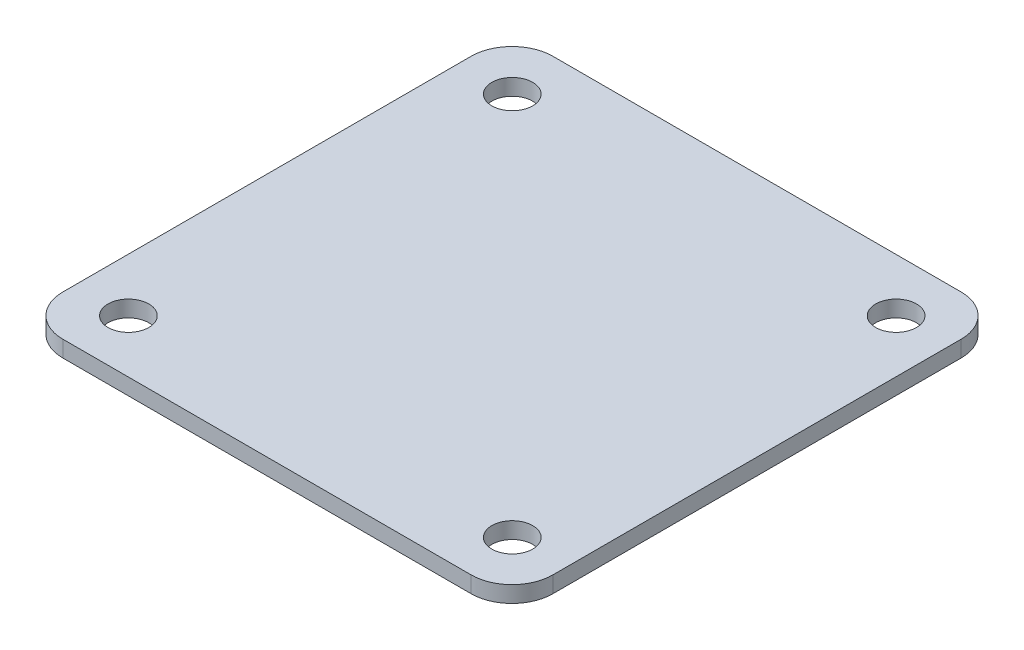
ISO-10303-21;
HEADER;
FILE_DESCRIPTION(('STEP AP214'),'2;1');
FILE_NAME('part.step','',(''),(''),'','','');
FILE_SCHEMA(('AUTOMOTIVE_DESIGN { 1 0 10303 214 1 1 1 1 }'));
ENDSEC;
DATA;
#1=APPLICATION_CONTEXT('core data for automotive mechanical design processes');
#2=APPLICATION_PROTOCOL_DEFINITION('international standard','automotive_design',2000,#1);
#3=PRODUCT_CONTEXT('',#1,'mechanical');
#4=PRODUCT('Part','Part','',(#3));
#5=PRODUCT_RELATED_PRODUCT_CATEGORY('part','',(#4));
#6=PRODUCT_DEFINITION_FORMATION('','',#4);
#7=PRODUCT_DEFINITION_CONTEXT('part definition',#1,'design');
#8=PRODUCT_DEFINITION('design','',#6,#7);
#9=PRODUCT_DEFINITION_SHAPE('','',#8);
#10=(LENGTH_UNIT() NAMED_UNIT(*) SI_UNIT(.MILLI.,.METRE.));
#11=(NAMED_UNIT(*) PLANE_ANGLE_UNIT() SI_UNIT($,.RADIAN.));
#12=(NAMED_UNIT(*) SI_UNIT($,.STERADIAN.) SOLID_ANGLE_UNIT());
#13=UNCERTAINTY_MEASURE_WITH_UNIT(LENGTH_MEASURE(1.E-05),#10,'distance_accuracy_value','');
#14=(GEOMETRIC_REPRESENTATION_CONTEXT(3) GLOBAL_UNCERTAINTY_ASSIGNED_CONTEXT((#13)) GLOBAL_UNIT_ASSIGNED_CONTEXT((#10,
#11,#12)) REPRESENTATION_CONTEXT('',''));
#15=CARTESIAN_POINT('',(0.,0.,0.));
#16=DIRECTION('',(0.,0.,1.));
#17=DIRECTION('',(1.,0.,0.));
#18=AXIS2_PLACEMENT_3D('',#15,#16,#17);
#19=CARTESIAN_POINT('',(0.,2.,0.));
#20=DIRECTION('',(0.,1.,0.));
#21=DIRECTION('',(0.,0.,1.));
#22=AXIS2_PLACEMENT_3D('',#19,#20,#21);
#23=PLANE('',#22);
#24=CARTESIAN_POINT('',(19.8025352645468,2.,35.4168591224018));
#25=DIRECTION('',(0.,1.,0.));
#26=DIRECTION('',(0.,0.,-1.));
#27=AXIS2_PLACEMENT_3D('',#24,#25,#26);
#28=CIRCLE('',#27,2.5);
#29=CARTESIAN_POINT('',(19.8025352645468,2.,32.9168591224019));
#30=VERTEX_POINT('',#29);
#31=EDGE_CURVE('E218',#30,#30,#28,.T.);
#32=ORIENTED_EDGE('',*,*,#31,.F.);
#33=EDGE_LOOP('',(#32));
#34=FACE_BOUND('',#33,.T.);
#35=CARTESIAN_POINT('',(19.8025352645468,2.,-11.5831408775981));
#36=DIRECTION('',(0.,1.,0.));
#37=DIRECTION('',(0.,0.,1.));
#38=AXIS2_PLACEMENT_3D('',#35,#36,#37);
#39=CIRCLE('',#38,2.5);
#40=CARTESIAN_POINT('',(19.8025352645468,2.,-9.08314087759814));
#41=VERTEX_POINT('',#40);
#42=EDGE_CURVE('E143',#41,#41,#39,.T.);
#43=ORIENTED_EDGE('',*,*,#42,.F.);
#44=EDGE_LOOP('',(#43));
#45=FACE_BOUND('',#44,.T.);
#46=DIRECTION('',(0.,0.,1.));
#47=VECTOR('',#46,1.);
#48=CARTESIAN_POINT('',(-33.7283796499798,2.,-18.0831408775981));
#49=LINE('',#48,#47);
#50=CARTESIAN_POINT('',(-33.7283796499798,2.,-13.0831408775981));
#51=VERTEX_POINT('',#50);
#52=CARTESIAN_POINT('',(-33.7283796499797,2.,36.9168591224019));
#53=VERTEX_POINT('',#52);
#54=EDGE_CURVE('E149',#51,#53,#49,.T.);
#55=ORIENTED_EDGE('',*,*,#54,.T.);
#56=CARTESIAN_POINT('',(-28.7283796499797,2.,36.9168591224019));
#57=DIRECTION('',(0.,1.,0.));
#58=DIRECTION('',(0.,0.,1.));
#59=AXIS2_PLACEMENT_3D('',#56,#57,#58);
#60=CIRCLE('',#59,5.);
#61=CARTESIAN_POINT('',(-28.7283796499797,2.,41.9168591224019));
#62=VERTEX_POINT('',#61);
#63=EDGE_CURVE('E173',#53,#62,#60,.T.);
#64=ORIENTED_EDGE('',*,*,#63,.T.);
#65=DIRECTION('',(1.,0.,0.));
#66=VECTOR('',#65,1.);
#67=CARTESIAN_POINT('',(-33.7283796499797,2.,41.9168591224019));
#68=LINE('',#67,#66);
#69=CARTESIAN_POINT('',(21.2716203500203,2.,41.9168591224019));
#70=VERTEX_POINT('',#69);
#71=EDGE_CURVE('E126',#62,#70,#68,.T.);
#72=ORIENTED_EDGE('',*,*,#71,.T.);
#73=CARTESIAN_POINT('',(21.2716203500203,2.,36.9168591224019));
#74=DIRECTION('',(0.,1.,0.));
#75=DIRECTION('',(0.,0.,1.));
#76=AXIS2_PLACEMENT_3D('',#73,#74,#75);
#77=CIRCLE('',#76,5.);
#78=CARTESIAN_POINT('',(26.2716203500203,2.,36.9168591224019));
#79=VERTEX_POINT('',#78);
#80=EDGE_CURVE('E165',#70,#79,#77,.T.);
#81=ORIENTED_EDGE('',*,*,#80,.T.);
#82=DIRECTION('',(0.,0.,-1.));
#83=VECTOR('',#82,1.);
#84=CARTESIAN_POINT('',(26.2716203500202,2.,-18.0831408775981));
#85=LINE('',#84,#83);
#86=CARTESIAN_POINT('',(26.2716203500202,2.,-13.0831408775981));
#87=VERTEX_POINT('',#86);
#88=EDGE_CURVE('E188',#79,#87,#85,.T.);
#89=ORIENTED_EDGE('',*,*,#88,.T.);
#90=CARTESIAN_POINT('',(21.2716203500202,2.,-13.0831408775981));
#91=DIRECTION('',(0.,1.,0.));
#92=DIRECTION('',(0.,0.,1.));
#93=AXIS2_PLACEMENT_3D('',#90,#91,#92);
#94=CIRCLE('',#93,5.);
#95=CARTESIAN_POINT('',(21.2716203500202,2.,-18.0831408775981));
#96=VERTEX_POINT('',#95);
#97=EDGE_CURVE('E61',#87,#96,#94,.T.);
#98=ORIENTED_EDGE('',*,*,#97,.T.);
#99=DIRECTION('',(-1.,0.,0.));
#100=VECTOR('',#99,1.);
#101=CARTESIAN_POINT('',(-33.7283796499798,2.,-18.0831408775981));
#102=LINE('',#101,#100);
#103=CARTESIAN_POINT('',(-28.7283796499798,2.,-18.0831408775981));
#104=VERTEX_POINT('',#103);
#105=EDGE_CURVE('E151',#96,#104,#102,.T.);
#106=ORIENTED_EDGE('',*,*,#105,.T.);
#107=CARTESIAN_POINT('',(-28.7283796499798,2.,-13.0831408775981));
#108=DIRECTION('',(0.,1.,0.));
#109=DIRECTION('',(0.,0.,1.));
#110=AXIS2_PLACEMENT_3D('',#107,#108,#109);
#111=CIRCLE('',#110,5.);
#112=EDGE_CURVE('E170',#104,#51,#111,.T.);
#113=ORIENTED_EDGE('',*,*,#112,.T.);
#114=EDGE_LOOP('',(#55,#64,#72,#81,#89,#98,#106,#113));
#115=FACE_BOUND('',#114,.T.);
#116=CARTESIAN_POINT('',(-27.1974647354532,2.,-11.5831408775981));
#117=DIRECTION('',(0.,1.,0.));
#118=DIRECTION('',(0.,0.,1.));
#119=AXIS2_PLACEMENT_3D('',#116,#117,#118);
#120=CIRCLE('',#119,2.5);
#121=CARTESIAN_POINT('',(-27.1974647354532,2.,-9.08314087759814));
#122=VERTEX_POINT('',#121);
#123=EDGE_CURVE('E210',#122,#122,#120,.T.);
#124=ORIENTED_EDGE('',*,*,#123,.F.);
#125=EDGE_LOOP('',(#124));
#126=FACE_BOUND('',#125,.T.);
#127=CARTESIAN_POINT('',(-27.1974647354532,2.,35.4168591224019));
#128=DIRECTION('',(0.,1.,0.));
#129=DIRECTION('',(0.,0.,-1.));
#130=AXIS2_PLACEMENT_3D('',#127,#128,#129);
#131=CIRCLE('',#130,2.5);
#132=CARTESIAN_POINT('',(-27.1974647354532,2.,32.9168591224019));
#133=VERTEX_POINT('',#132);
#134=EDGE_CURVE('E226',#133,#133,#131,.T.);
#135=ORIENTED_EDGE('',*,*,#134,.F.);
#136=EDGE_LOOP('',(#135));
#137=FACE_BOUND('',#136,.T.);
#138=ADVANCED_FACE('F38',(#34,#45,#115,#126,#137),#23,.T.);
#139=CARTESIAN_POINT('',(0.,0.,0.));
#140=DIRECTION('',(0.,1.,0.));
#141=DIRECTION('',(0.,0.,1.));
#142=AXIS2_PLACEMENT_3D('',#139,#140,#141);
#143=PLANE('',#142);
#144=DIRECTION('',(1.,0.,0.));
#145=VECTOR('',#144,1.);
#146=CARTESIAN_POINT('',(-33.7283796499797,0.,41.9168591224019));
#147=LINE('',#146,#145);
#148=CARTESIAN_POINT('',(-28.7283796499797,0.,41.9168591224019));
#149=VERTEX_POINT('',#148);
#150=CARTESIAN_POINT('',(21.2716203500203,0.,41.9168591224019));
#151=VERTEX_POINT('',#150);
#152=EDGE_CURVE('E123',#149,#151,#147,.T.);
#153=ORIENTED_EDGE('',*,*,#152,.F.);
#154=CARTESIAN_POINT('',(-28.7283796499797,0.,36.9168591224019));
#155=DIRECTION('',(0.,1.,0.));
#156=DIRECTION('',(0.,0.,1.));
#157=AXIS2_PLACEMENT_3D('',#154,#155,#156);
#158=CIRCLE('',#157,5.);
#159=CARTESIAN_POINT('',(-33.7283796499797,0.,36.9168591224019));
#160=VERTEX_POINT('',#159);
#161=EDGE_CURVE('E105',#149,#160,#158,.F.);
#162=ORIENTED_EDGE('',*,*,#161,.T.);
#163=DIRECTION('',(0.,0.,1.));
#164=VECTOR('',#163,1.);
#165=CARTESIAN_POINT('',(-33.7283796499798,0.,-18.0831408775981));
#166=LINE('',#165,#164);
#167=CARTESIAN_POINT('',(-33.7283796499798,0.,-13.0831408775981));
#168=VERTEX_POINT('',#167);
#169=EDGE_CURVE('E136',#168,#160,#166,.T.);
#170=ORIENTED_EDGE('',*,*,#169,.F.);
#171=CARTESIAN_POINT('',(-28.7283796499798,0.,-13.0831408775981));
#172=DIRECTION('',(0.,1.,0.));
#173=DIRECTION('',(0.,0.,1.));
#174=AXIS2_PLACEMENT_3D('',#171,#172,#173);
#175=CIRCLE('',#174,5.);
#176=CARTESIAN_POINT('',(-28.7283796499798,0.,-18.0831408775981));
#177=VERTEX_POINT('',#176);
#178=EDGE_CURVE('E117',#168,#177,#175,.F.);
#179=ORIENTED_EDGE('',*,*,#178,.T.);
#180=DIRECTION('',(-1.,0.,0.));
#181=VECTOR('',#180,1.);
#182=CARTESIAN_POINT('',(-33.7283796499798,0.,-18.0831408775981));
#183=LINE('',#182,#181);
#184=CARTESIAN_POINT('',(21.2716203500202,0.,-18.0831408775981));
#185=VERTEX_POINT('',#184);
#186=EDGE_CURVE('E141',#185,#177,#183,.T.);
#187=ORIENTED_EDGE('',*,*,#186,.F.);
#188=CARTESIAN_POINT('',(21.2716203500202,0.,-13.0831408775981));
#189=DIRECTION('',(0.,1.,0.));
#190=DIRECTION('',(0.,0.,1.));
#191=AXIS2_PLACEMENT_3D('',#188,#189,#190);
#192=CIRCLE('',#191,5.);
#193=CARTESIAN_POINT('',(26.2716203500202,0.,-13.0831408775981));
#194=VERTEX_POINT('',#193);
#195=EDGE_CURVE('E155',#185,#194,#192,.F.);
#196=ORIENTED_EDGE('',*,*,#195,.T.);
#197=DIRECTION('',(0.,0.,-1.));
#198=VECTOR('',#197,1.);
#199=CARTESIAN_POINT('',(26.2716203500202,0.,-18.0831408775981));
#200=LINE('',#199,#198);
#201=CARTESIAN_POINT('',(26.2716203500203,0.,36.9168591224019));
#202=VERTEX_POINT('',#201);
#203=EDGE_CURVE('E135',#202,#194,#200,.T.);
#204=ORIENTED_EDGE('',*,*,#203,.F.);
#205=CARTESIAN_POINT('',(21.2716203500203,0.,36.9168591224019));
#206=DIRECTION('',(0.,1.,0.));
#207=DIRECTION('',(0.,0.,1.));
#208=AXIS2_PLACEMENT_3D('',#205,#206,#207);
#209=CIRCLE('',#208,5.);
#210=EDGE_CURVE('E128',#202,#151,#209,.F.);
#211=ORIENTED_EDGE('',*,*,#210,.T.);
#212=EDGE_LOOP('',(#153,#162,#170,#179,#187,#196,#204,#211));
#213=FACE_BOUND('',#212,.T.);
#214=CARTESIAN_POINT('',(19.8025352645468,0.,-11.5831408775981));
#215=DIRECTION('',(0.,1.,0.));
#216=DIRECTION('',(0.,0.,1.));
#217=AXIS2_PLACEMENT_3D('',#214,#215,#216);
#218=CIRCLE('',#217,2.5);
#219=CARTESIAN_POINT('',(19.8025352645468,0.,-9.08314087759814));
#220=VERTEX_POINT('',#219);
#221=EDGE_CURVE('E206',#220,#220,#218,.T.);
#222=ORIENTED_EDGE('',*,*,#221,.T.);
#223=EDGE_LOOP('',(#222));
#224=FACE_BOUND('',#223,.T.);
#225=CARTESIAN_POINT('',(-27.1974647354532,0.,-11.5831408775981));
#226=DIRECTION('',(0.,1.,0.));
#227=DIRECTION('',(0.,0.,1.));
#228=AXIS2_PLACEMENT_3D('',#225,#226,#227);
#229=CIRCLE('',#228,2.5);
#230=CARTESIAN_POINT('',(-27.1974647354532,0.,-9.08314087759814));
#231=VERTEX_POINT('',#230);
#232=EDGE_CURVE('E214',#231,#231,#229,.T.);
#233=ORIENTED_EDGE('',*,*,#232,.T.);
#234=EDGE_LOOP('',(#233));
#235=FACE_BOUND('',#234,.T.);
#236=CARTESIAN_POINT('',(19.8025352645468,0.,35.4168591224018));
#237=DIRECTION('',(0.,1.,0.));
#238=DIRECTION('',(0.,0.,-1.));
#239=AXIS2_PLACEMENT_3D('',#236,#237,#238);
#240=CIRCLE('',#239,2.5);
#241=CARTESIAN_POINT('',(19.8025352645468,0.,32.9168591224019));
#242=VERTEX_POINT('',#241);
#243=EDGE_CURVE('E222',#242,#242,#240,.T.);
#244=ORIENTED_EDGE('',*,*,#243,.T.);
#245=EDGE_LOOP('',(#244));
#246=FACE_BOUND('',#245,.T.);
#247=CARTESIAN_POINT('',(-27.1974647354532,0.,35.4168591224019));
#248=DIRECTION('',(0.,1.,0.));
#249=DIRECTION('',(0.,0.,-1.));
#250=AXIS2_PLACEMENT_3D('',#247,#248,#249);
#251=CIRCLE('',#250,2.5);
#252=CARTESIAN_POINT('',(-27.1974647354532,0.,32.9168591224019));
#253=VERTEX_POINT('',#252);
#254=EDGE_CURVE('E230',#253,#253,#251,.T.);
#255=ORIENTED_EDGE('',*,*,#254,.T.);
#256=EDGE_LOOP('',(#255));
#257=FACE_BOUND('',#256,.T.);
#258=ADVANCED_FACE('F131',(#213,#224,#235,#246,#257),#143,.F.);
#259=CARTESIAN_POINT('',(-33.7283796499798,2.,-18.0831408775981));
#260=DIRECTION('',(1.,0.,0.));
#261=DIRECTION('',(0.,0.,-1.));
#262=AXIS2_PLACEMENT_3D('',#259,#260,#261);
#263=PLANE('',#262);
#264=ORIENTED_EDGE('',*,*,#169,.T.);
#265=DIRECTION('',(0.,-1.,0.));
#266=VECTOR('',#265,1.);
#267=CARTESIAN_POINT('',(-33.7283796499797,2.,36.9168591224019));
#268=LINE('',#267,#266);
#269=EDGE_CURVE('E110',#160,#53,#268,.F.);
#270=ORIENTED_EDGE('',*,*,#269,.T.);
#271=ORIENTED_EDGE('',*,*,#54,.F.);
#272=DIRECTION('',(0.,-1.,0.));
#273=VECTOR('',#272,1.);
#274=CARTESIAN_POINT('',(-33.7283796499798,2.,-13.0831408775981));
#275=LINE('',#274,#273);
#276=EDGE_CURVE('E116',#51,#168,#275,.T.);
#277=ORIENTED_EDGE('',*,*,#276,.T.);
#278=EDGE_LOOP('',(#264,#270,#271,#277));
#279=FACE_BOUND('',#278,.T.);
#280=ADVANCED_FACE('F248',(#279),#263,.F.);
#281=CARTESIAN_POINT('',(-33.7283796499797,2.,41.9168591224019));
#282=DIRECTION('',(0.,0.,-1.));
#283=DIRECTION('',(-1.,0.,0.));
#284=AXIS2_PLACEMENT_3D('',#281,#282,#283);
#285=PLANE('',#284);
#286=ORIENTED_EDGE('',*,*,#71,.F.);
#287=DIRECTION('',(0.,-1.,0.));
#288=VECTOR('',#287,1.);
#289=CARTESIAN_POINT('',(-28.7283796499797,2.,41.9168591224019));
#290=LINE('',#289,#288);
#291=EDGE_CURVE('E109',#62,#149,#290,.T.);
#292=ORIENTED_EDGE('',*,*,#291,.T.);
#293=ORIENTED_EDGE('',*,*,#152,.T.);
#294=DIRECTION('',(0.,-1.,0.));
#295=VECTOR('',#294,1.);
#296=CARTESIAN_POINT('',(21.2716203500203,2.,41.9168591224019));
#297=LINE('',#296,#295);
#298=EDGE_CURVE('E129',#151,#70,#297,.F.);
#299=ORIENTED_EDGE('',*,*,#298,.T.);
#300=EDGE_LOOP('',(#286,#292,#293,#299));
#301=FACE_BOUND('',#300,.T.);
#302=ADVANCED_FACE('F122',(#301),#285,.F.);
#303=CARTESIAN_POINT('',(26.2716203500202,2.,-18.0831408775981));
#304=DIRECTION('',(-1.,0.,0.));
#305=DIRECTION('',(0.,0.,1.));
#306=AXIS2_PLACEMENT_3D('',#303,#304,#305);
#307=PLANE('',#306);
#308=ORIENTED_EDGE('',*,*,#203,.T.);
#309=DIRECTION('',(0.,-1.,0.));
#310=VECTOR('',#309,1.);
#311=CARTESIAN_POINT('',(26.2716203500202,2.,-13.0831408775981));
#312=LINE('',#311,#310);
#313=EDGE_CURVE('E11',#194,#87,#312,.F.);
#314=ORIENTED_EDGE('',*,*,#313,.T.);
#315=ORIENTED_EDGE('',*,*,#88,.F.);
#316=DIRECTION('',(0.,-1.,0.));
#317=VECTOR('',#316,1.);
#318=CARTESIAN_POINT('',(26.2716203500203,2.,36.9168591224019));
#319=LINE('',#318,#317);
#320=EDGE_CURVE('E47',#79,#202,#319,.T.);
#321=ORIENTED_EDGE('',*,*,#320,.T.);
#322=EDGE_LOOP('',(#308,#314,#315,#321));
#323=FACE_BOUND('',#322,.T.);
#324=ADVANCED_FACE('F186',(#323),#307,.F.);
#325=CARTESIAN_POINT('',(-33.7283796499798,2.,-18.0831408775981));
#326=DIRECTION('',(0.,0.,1.));
#327=DIRECTION('',(1.,0.,0.));
#328=AXIS2_PLACEMENT_3D('',#325,#326,#327);
#329=PLANE('',#328);
#330=ORIENTED_EDGE('',*,*,#186,.T.);
#331=DIRECTION('',(0.,-1.,0.));
#332=VECTOR('',#331,1.);
#333=CARTESIAN_POINT('',(-28.7283796499798,2.,-18.0831408775981));
#334=LINE('',#333,#332);
#335=EDGE_CURVE('E54',#177,#104,#334,.F.);
#336=ORIENTED_EDGE('',*,*,#335,.T.);
#337=ORIENTED_EDGE('',*,*,#105,.F.);
#338=DIRECTION('',(0.,-1.,0.));
#339=VECTOR('',#338,1.);
#340=CARTESIAN_POINT('',(21.2716203500202,2.,-18.0831408775981));
#341=LINE('',#340,#339);
#342=EDGE_CURVE('E176',#96,#185,#341,.T.);
#343=ORIENTED_EDGE('',*,*,#342,.T.);
#344=EDGE_LOOP('',(#330,#336,#337,#343));
#345=FACE_BOUND('',#344,.T.);
#346=ADVANCED_FACE('F195',(#345),#329,.F.);
#347=CARTESIAN_POINT('',(19.8025352645468,2.,-11.5831408775981));
#348=DIRECTION('',(0.,-1.,0.));
#349=DIRECTION('',(0.,0.,-1.));
#350=AXIS2_PLACEMENT_3D('',#347,#348,#349);
#351=CYLINDRICAL_SURFACE('',#350,2.5);
#352=ORIENTED_EDGE('',*,*,#42,.T.);
#353=EDGE_LOOP('',(#352));
#354=FACE_BOUND('',#353,.T.);
#355=ORIENTED_EDGE('',*,*,#221,.F.);
#356=EDGE_LOOP('',(#355));
#357=FACE_BOUND('',#356,.T.);
#358=ADVANCED_FACE('F253',(#354,#357),#351,.F.);
#359=CARTESIAN_POINT('',(-27.1974647354532,2.,-11.5831408775981));
#360=DIRECTION('',(0.,-1.,0.));
#361=DIRECTION('',(0.,0.,-1.));
#362=AXIS2_PLACEMENT_3D('',#359,#360,#361);
#363=CYLINDRICAL_SURFACE('',#362,2.5);
#364=ORIENTED_EDGE('',*,*,#123,.T.);
#365=EDGE_LOOP('',(#364));
#366=FACE_BOUND('',#365,.T.);
#367=ORIENTED_EDGE('',*,*,#232,.F.);
#368=EDGE_LOOP('',(#367));
#369=FACE_BOUND('',#368,.T.);
#370=ADVANCED_FACE('F281',(#366,#369),#363,.F.);
#371=CARTESIAN_POINT('',(19.8025352645468,2.,35.4168591224018));
#372=DIRECTION('',(0.,-1.,0.));
#373=DIRECTION('',(0.,0.,-1.));
#374=AXIS2_PLACEMENT_3D('',#371,#372,#373);
#375=CYLINDRICAL_SURFACE('',#374,2.5);
#376=ORIENTED_EDGE('',*,*,#31,.T.);
#377=EDGE_LOOP('',(#376));
#378=FACE_BOUND('',#377,.T.);
#379=ORIENTED_EDGE('',*,*,#243,.F.);
#380=EDGE_LOOP('',(#379));
#381=FACE_BOUND('',#380,.T.);
#382=ADVANCED_FACE('F284',(#378,#381),#375,.F.);
#383=CARTESIAN_POINT('',(-27.1974647354532,2.,35.4168591224019));
#384=DIRECTION('',(0.,-1.,0.));
#385=DIRECTION('',(0.,0.,-1.));
#386=AXIS2_PLACEMENT_3D('',#383,#384,#385);
#387=CYLINDRICAL_SURFACE('',#386,2.5);
#388=ORIENTED_EDGE('',*,*,#134,.T.);
#389=EDGE_LOOP('',(#388));
#390=FACE_BOUND('',#389,.T.);
#391=ORIENTED_EDGE('',*,*,#254,.F.);
#392=EDGE_LOOP('',(#391));
#393=FACE_BOUND('',#392,.T.);
#394=ADVANCED_FACE('F238',(#390,#393),#387,.F.);
#395=CARTESIAN_POINT('',(-28.7283796499797,2.,36.9168591224019));
#396=DIRECTION('',(0.,-1.,0.));
#397=DIRECTION('',(0.,0.,-1.));
#398=AXIS2_PLACEMENT_3D('',#395,#396,#397);
#399=CYLINDRICAL_SURFACE('',#398,5.);
#400=ORIENTED_EDGE('',*,*,#63,.F.);
#401=ORIENTED_EDGE('',*,*,#269,.F.);
#402=ORIENTED_EDGE('',*,*,#161,.F.);
#403=ORIENTED_EDGE('',*,*,#291,.F.);
#404=EDGE_LOOP('',(#400,#401,#402,#403));
#405=FACE_BOUND('',#404,.T.);
#406=ADVANCED_FACE('F108',(#405),#399,.T.);
#407=CARTESIAN_POINT('',(-28.7283796499798,2.,-13.0831408775981));
#408=DIRECTION('',(0.,-1.,0.));
#409=DIRECTION('',(0.,0.,-1.));
#410=AXIS2_PLACEMENT_3D('',#407,#408,#409);
#411=CYLINDRICAL_SURFACE('',#410,5.);
#412=ORIENTED_EDGE('',*,*,#112,.F.);
#413=ORIENTED_EDGE('',*,*,#335,.F.);
#414=ORIENTED_EDGE('',*,*,#178,.F.);
#415=ORIENTED_EDGE('',*,*,#276,.F.);
#416=EDGE_LOOP('',(#412,#413,#414,#415));
#417=FACE_BOUND('',#416,.T.);
#418=ADVANCED_FACE('F267',(#417),#411,.T.);
#419=CARTESIAN_POINT('',(21.2716203500202,2.,-13.0831408775981));
#420=DIRECTION('',(0.,-1.,0.));
#421=DIRECTION('',(0.,0.,-1.));
#422=AXIS2_PLACEMENT_3D('',#419,#420,#421);
#423=CYLINDRICAL_SURFACE('',#422,5.);
#424=ORIENTED_EDGE('',*,*,#97,.F.);
#425=ORIENTED_EDGE('',*,*,#313,.F.);
#426=ORIENTED_EDGE('',*,*,#195,.F.);
#427=ORIENTED_EDGE('',*,*,#342,.F.);
#428=EDGE_LOOP('',(#424,#425,#426,#427));
#429=FACE_BOUND('',#428,.T.);
#430=ADVANCED_FACE('F194',(#429),#423,.T.);
#431=CARTESIAN_POINT('',(21.2716203500203,2.,36.9168591224019));
#432=DIRECTION('',(0.,-1.,0.));
#433=DIRECTION('',(0.,0.,-1.));
#434=AXIS2_PLACEMENT_3D('',#431,#432,#433);
#435=CYLINDRICAL_SURFACE('',#434,5.);
#436=ORIENTED_EDGE('',*,*,#80,.F.);
#437=ORIENTED_EDGE('',*,*,#298,.F.);
#438=ORIENTED_EDGE('',*,*,#210,.F.);
#439=ORIENTED_EDGE('',*,*,#320,.F.);
#440=EDGE_LOOP('',(#436,#437,#438,#439));
#441=FACE_BOUND('',#440,.T.);
#442=ADVANCED_FACE('F40',(#441),#435,.T.);
#443=CLOSED_SHELL('',(#138,#258,#280,#302,#324,#346,#358,#370,#382,#394,#406,#418,#430,#442));
#444=MANIFOLD_SOLID_BREP('B2',#443);
#445=ADVANCED_BREP_SHAPE_REPRESENTATION('',(#18,#444),#14);
#446=SHAPE_DEFINITION_REPRESENTATION(#9,#445);
ENDSEC;
END-ISO-10303-21;
